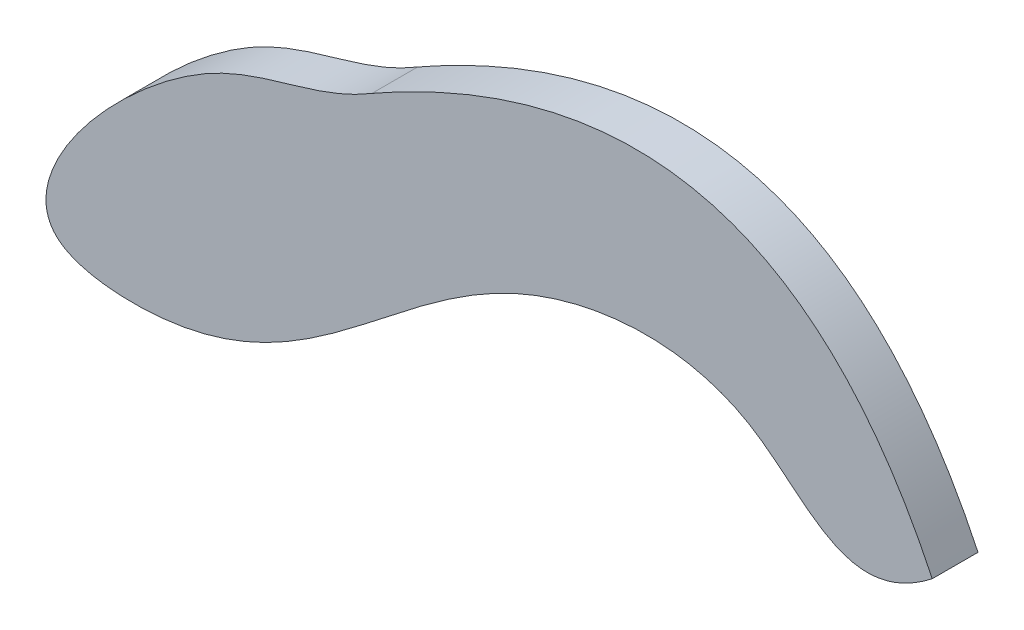
ISO-10303-21;
HEADER;
FILE_DESCRIPTION(('STEP AP214'),'2;1');
FILE_NAME('part.step','',(''),(''),'','','');
FILE_SCHEMA(('AUTOMOTIVE_DESIGN { 1 0 10303 214 1 1 1 1 }'));
ENDSEC;
DATA;
#1=APPLICATION_CONTEXT('core data for automotive mechanical design processes');
#2=APPLICATION_PROTOCOL_DEFINITION('international standard','automotive_design',2000,#1);
#3=PRODUCT_CONTEXT('',#1,'mechanical');
#4=PRODUCT('Part','Part','',(#3));
#5=PRODUCT_RELATED_PRODUCT_CATEGORY('part','',(#4));
#6=PRODUCT_DEFINITION_FORMATION('','',#4);
#7=PRODUCT_DEFINITION_CONTEXT('part definition',#1,'design');
#8=PRODUCT_DEFINITION('design','',#6,#7);
#9=PRODUCT_DEFINITION_SHAPE('','',#8);
#10=(LENGTH_UNIT() NAMED_UNIT(*) SI_UNIT(.MILLI.,.METRE.));
#11=(NAMED_UNIT(*) PLANE_ANGLE_UNIT() SI_UNIT($,.RADIAN.));
#12=(NAMED_UNIT(*) SI_UNIT($,.STERADIAN.) SOLID_ANGLE_UNIT());
#13=UNCERTAINTY_MEASURE_WITH_UNIT(LENGTH_MEASURE(1.E-05),#10,'distance_accuracy_value','');
#14=(GEOMETRIC_REPRESENTATION_CONTEXT(3) GLOBAL_UNCERTAINTY_ASSIGNED_CONTEXT((#13)) GLOBAL_UNIT_ASSIGNED_CONTEXT((#10,
#11,#12)) REPRESENTATION_CONTEXT('',''));
#15=CARTESIAN_POINT('',(0.,0.,0.));
#16=DIRECTION('',(0.,0.,1.));
#17=DIRECTION('',(1.,0.,0.));
#18=AXIS2_PLACEMENT_3D('',#15,#16,#17);
#19=CARTESIAN_POINT('',(-73.8512683578104,4.79217289719626,7.));
#20=CARTESIAN_POINT('',(-82.528171317332,-0.43501210927055,7.));
#21=CARTESIAN_POINT('',(-101.008849879795,0.414800689545015,7.));
#22=CARTESIAN_POINT('',(-135.942757700105,-39.4316496979145,7.));
#23=CARTESIAN_POINT('',(-85.4931197249887,-44.0140585627238,7.));
#24=CARTESIAN_POINT('',(-64.701174525551,-7.70976080503054,7.));
#25=CARTESIAN_POINT('',(-13.7058107164268,-3.20430955768124,7.));
#26=CARTESIAN_POINT('',(-1.14309273456945,-26.8273776561434,7.));
#27=CARTESIAN_POINT('',(11.9034045393858,-16.6464953271028,7.));
#28=B_SPLINE_CURVE_WITH_KNOTS('',3,(#19,#20,#21,#22,#23,#24,#25,#26,#27),.UNSPECIFIED.,.F.,.F.,
(4,1,1,1,1,1,4),(0.,0.126469763218016,0.317987768142517,0.389105155679778,0.692806595622148,
0.855625853329183,1.),.UNSPECIFIED.);
#29=DIRECTION('',(0.,0.,-1.));
#30=VECTOR('',#29,1.);
#31=SURFACE_OF_LINEAR_EXTRUSION('',#28,#30);
#32=CARTESIAN_POINT('',(-73.8512683578104,4.79217289719626,0.));
#33=CARTESIAN_POINT('',(-82.528171317332,-0.43501210927055,0.));
#34=CARTESIAN_POINT('',(-101.008849879795,0.414800689545015,0.));
#35=CARTESIAN_POINT('',(-135.942757700105,-39.4316496979145,0.));
#36=CARTESIAN_POINT('',(-85.4931197249887,-44.0140585627238,0.));
#37=CARTESIAN_POINT('',(-64.701174525551,-7.70976080503054,0.));
#38=CARTESIAN_POINT('',(-13.7058107164268,-3.20430955768124,0.));
#39=CARTESIAN_POINT('',(-1.14309273456945,-26.8273776561434,0.));
#40=CARTESIAN_POINT('',(11.9034045393858,-16.6464953271028,0.));
#41=B_SPLINE_CURVE_WITH_KNOTS('',3,(#32,#33,#34,#35,#36,#37,#38,#39,#40),.UNSPECIFIED.,.F.,.F.,
(4,1,1,1,1,1,4),(0.,0.126469763218016,0.317987768142517,0.389105155679778,0.692806595622148,
0.855625853329183,1.),.UNSPECIFIED.);
#42=CARTESIAN_POINT('',(-73.8512683578104,4.79217289719626,0.));
#43=VERTEX_POINT('',#42);
#44=CARTESIAN_POINT('',(11.9034045393859,-16.6464953271028,0.));
#45=VERTEX_POINT('',#44);
#46=EDGE_CURVE('E65',#43,#45,#41,.T.);
#47=ORIENTED_EDGE('',*,*,#46,.T.);
#48=DIRECTION('',(0.,0.,-1.));
#49=VECTOR('',#48,1.);
#50=CARTESIAN_POINT('',(11.9034045393859,-16.6464953271028,7.));
#51=LINE('',#50,#49);
#52=CARTESIAN_POINT('',(11.9034045393859,-16.6464953271028,7.));
#53=VERTEX_POINT('',#52);
#54=EDGE_CURVE('E11',#53,#45,#51,.T.);
#55=ORIENTED_EDGE('',*,*,#54,.F.);
#56=CARTESIAN_POINT('',(-73.8512683578104,4.79217289719626,7.));
#57=VERTEX_POINT('',#56);
#58=EDGE_CURVE('E64',#57,#53,#28,.T.);
#59=ORIENTED_EDGE('',*,*,#58,.F.);
#60=DIRECTION('',(0.,0.,-1.));
#61=VECTOR('',#60,1.);
#62=CARTESIAN_POINT('',(-73.8512683578104,4.79217289719626,7.));
#63=LINE('',#62,#61);
#64=EDGE_CURVE('E42',#57,#43,#63,.T.);
#65=ORIENTED_EDGE('',*,*,#64,.T.);
#66=EDGE_LOOP('',(#47,#55,#59,#65));
#67=FACE_BOUND('',#66,.T.);
#68=ADVANCED_FACE('F33',(#67),#31,.F.);
#69=CARTESIAN_POINT('',(11.9034045393859,-16.6464953271028,7.));
#70=CARTESIAN_POINT('',(-14.3553442057986,38.5733862390978,7.));
#71=CARTESIAN_POINT('',(-73.8512683578104,4.79217289719626,7.));
#72=B_SPLINE_CURVE_WITH_KNOTS('',2,(#69,#70,#71),.UNSPECIFIED.,.F.,.F.,(3,3),(0.,1.),.UNSPECIFIED.);
#73=DIRECTION('',(0.,0.,-1.));
#74=VECTOR('',#73,1.);
#75=SURFACE_OF_LINEAR_EXTRUSION('',#72,#74);
#76=CARTESIAN_POINT('',(11.9034045393859,-16.6464953271028,0.));
#77=CARTESIAN_POINT('',(-14.3553442057986,38.5733862390978,0.));
#78=CARTESIAN_POINT('',(-73.8512683578104,4.79217289719626,0.));
#79=B_SPLINE_CURVE_WITH_KNOTS('',2,(#76,#77,#78),.UNSPECIFIED.,.F.,.F.,(3,3),(0.,1.),.UNSPECIFIED.);
#80=EDGE_CURVE('E57',#45,#43,#79,.T.);
#81=ORIENTED_EDGE('',*,*,#80,.T.);
#82=ORIENTED_EDGE('',*,*,#64,.F.);
#83=EDGE_CURVE('E49',#53,#57,#72,.T.);
#84=ORIENTED_EDGE('',*,*,#83,.F.);
#85=ORIENTED_EDGE('',*,*,#54,.T.);
#86=EDGE_LOOP('',(#81,#82,#84,#85));
#87=FACE_BOUND('',#86,.T.);
#88=ADVANCED_FACE('F60',(#87),#75,.F.);
#89=CARTESIAN_POINT('',(-84.3646253617952,-33.0724933890627,7.));
#90=DIRECTION('',(0.,0.,1.));
#91=DIRECTION('',(1.,0.,0.));
#92=AXIS2_PLACEMENT_3D('',#89,#90,#91);
#93=PLANE('',#92);
#94=ORIENTED_EDGE('',*,*,#58,.T.);
#95=ORIENTED_EDGE('',*,*,#83,.T.);
#96=EDGE_LOOP('',(#94,#95));
#97=FACE_BOUND('',#96,.T.);
#98=ADVANCED_FACE('F92',(#97),#93,.T.);
#99=CARTESIAN_POINT('',(-84.3646253617952,-33.0724933890627,0.));
#100=DIRECTION('',(0.,0.,1.));
#101=DIRECTION('',(1.,0.,0.));
#102=AXIS2_PLACEMENT_3D('',#99,#100,#101);
#103=PLANE('',#102);
#104=ORIENTED_EDGE('',*,*,#46,.F.);
#105=ORIENTED_EDGE('',*,*,#80,.F.);
#106=EDGE_LOOP('',(#104,#105));
#107=FACE_BOUND('',#106,.T.);
#108=ADVANCED_FACE('F68',(#107),#103,.F.);
#109=CLOSED_SHELL('',(#68,#88,#98,#108));
#110=MANIFOLD_SOLID_BREP('B2',#109);
#111=ADVANCED_BREP_SHAPE_REPRESENTATION('',(#18,#110),#14);
#112=SHAPE_DEFINITION_REPRESENTATION(#9,#111);
ENDSEC;
END-ISO-10303-21;
